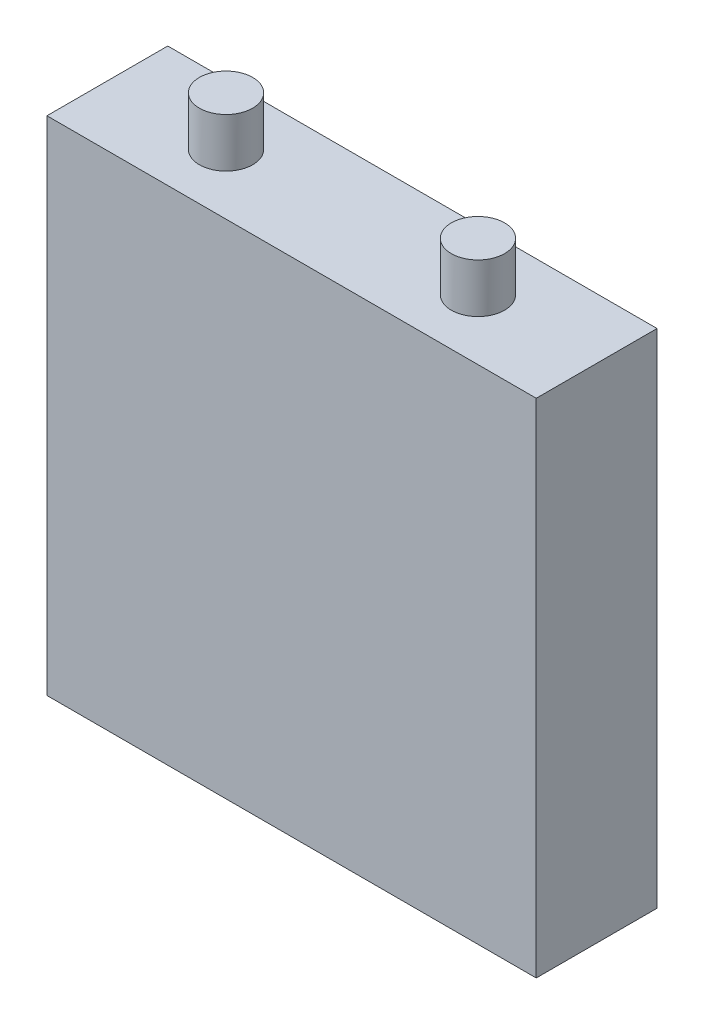
ISO-10303-21;
HEADER;
FILE_DESCRIPTION(('STEP AP214'),'2;1');
FILE_NAME('part.step','',(''),(''),'','','');
FILE_SCHEMA(('AUTOMOTIVE_DESIGN { 1 0 10303 214 1 1 1 1 }'));
ENDSEC;
DATA;
#1=APPLICATION_CONTEXT('core data for automotive mechanical design processes');
#2=APPLICATION_PROTOCOL_DEFINITION('international standard','automotive_design',2000,#1);
#3=PRODUCT_CONTEXT('',#1,'mechanical');
#4=PRODUCT('Part','Part','',(#3));
#5=PRODUCT_RELATED_PRODUCT_CATEGORY('part','',(#4));
#6=PRODUCT_DEFINITION_FORMATION('','',#4);
#7=PRODUCT_DEFINITION_CONTEXT('part definition',#1,'design');
#8=PRODUCT_DEFINITION('design','',#6,#7);
#9=PRODUCT_DEFINITION_SHAPE('','',#8);
#10=(LENGTH_UNIT() NAMED_UNIT(*) SI_UNIT(.MILLI.,.METRE.));
#11=(NAMED_UNIT(*) PLANE_ANGLE_UNIT() SI_UNIT($,.RADIAN.));
#12=(NAMED_UNIT(*) SI_UNIT($,.STERADIAN.) SOLID_ANGLE_UNIT());
#13=UNCERTAINTY_MEASURE_WITH_UNIT(LENGTH_MEASURE(1.E-05),#10,'distance_accuracy_value','');
#14=(GEOMETRIC_REPRESENTATION_CONTEXT(3) GLOBAL_UNCERTAINTY_ASSIGNED_CONTEXT((#13)) GLOBAL_UNIT_ASSIGNED_CONTEXT((#10,
#11,#12)) REPRESENTATION_CONTEXT('',''));
#15=CARTESIAN_POINT('',(0.,0.,0.));
#16=DIRECTION('',(0.,0.,1.));
#17=DIRECTION('',(1.,0.,0.));
#18=AXIS2_PLACEMENT_3D('',#15,#16,#17);
#19=CARTESIAN_POINT('',(0.,141.3,0.));
#20=DIRECTION('',(1.,0.,0.));
#21=DIRECTION('',(0.,0.,-1.));
#22=AXIS2_PLACEMENT_3D('',#19,#20,#21);
#23=PLANE('',#22);
#24=DIRECTION('',(0.,0.,1.));
#25=VECTOR('',#24,1.);
#26=CARTESIAN_POINT('',(0.,0.,0.));
#27=LINE('',#26,#25);
#28=CARTESIAN_POINT('',(0.,0.,-34.));
#29=VERTEX_POINT('',#28);
#30=CARTESIAN_POINT('',(0.,0.,0.));
#31=VERTEX_POINT('',#30);
#32=EDGE_CURVE('E111',#29,#31,#27,.T.);
#33=ORIENTED_EDGE('',*,*,#32,.T.);
#34=DIRECTION('',(0.,-1.,0.));
#35=VECTOR('',#34,1.);
#36=CARTESIAN_POINT('',(0.,141.3,0.));
#37=LINE('',#36,#35);
#38=CARTESIAN_POINT('',(0.,141.3,0.));
#39=VERTEX_POINT('',#38);
#40=EDGE_CURVE('E100',#39,#31,#37,.T.);
#41=ORIENTED_EDGE('',*,*,#40,.F.);
#42=DIRECTION('',(0.,0.,1.));
#43=VECTOR('',#42,1.);
#44=CARTESIAN_POINT('',(0.,141.3,0.));
#45=LINE('',#44,#43);
#46=CARTESIAN_POINT('',(0.,141.3,-34.));
#47=VERTEX_POINT('',#46);
#48=EDGE_CURVE('E92',#47,#39,#45,.T.);
#49=ORIENTED_EDGE('',*,*,#48,.F.);
#50=DIRECTION('',(0.,-1.,0.));
#51=VECTOR('',#50,1.);
#52=CARTESIAN_POINT('',(0.,141.3,-34.));
#53=LINE('',#52,#51);
#54=EDGE_CURVE('E107',#47,#29,#53,.T.);
#55=ORIENTED_EDGE('',*,*,#54,.T.);
#56=EDGE_LOOP('',(#33,#41,#49,#55));
#57=FACE_BOUND('',#56,.T.);
#58=ADVANCED_FACE('F39',(#57),#23,.F.);
#59=CARTESIAN_POINT('',(0.,141.3,0.));
#60=DIRECTION('',(0.,0.,-1.));
#61=DIRECTION('',(-1.,0.,0.));
#62=AXIS2_PLACEMENT_3D('',#59,#60,#61);
#63=PLANE('',#62);
#64=DIRECTION('',(1.,0.,0.));
#65=VECTOR('',#64,1.);
#66=CARTESIAN_POINT('',(0.,0.,0.));
#67=LINE('',#66,#65);
#68=CARTESIAN_POINT('',(137.7,0.,0.));
#69=VERTEX_POINT('',#68);
#70=EDGE_CURVE('E98',#31,#69,#67,.T.);
#71=ORIENTED_EDGE('',*,*,#70,.T.);
#72=DIRECTION('',(0.,-1.,0.));
#73=VECTOR('',#72,1.);
#74=CARTESIAN_POINT('',(137.7,141.3,0.));
#75=LINE('',#74,#73);
#76=CARTESIAN_POINT('',(137.7,141.3,0.));
#77=VERTEX_POINT('',#76);
#78=EDGE_CURVE('E96',#77,#69,#75,.T.);
#79=ORIENTED_EDGE('',*,*,#78,.F.);
#80=DIRECTION('',(1.,0.,0.));
#81=VECTOR('',#80,1.);
#82=CARTESIAN_POINT('',(0.,141.3,0.));
#83=LINE('',#82,#81);
#84=EDGE_CURVE('E87',#39,#77,#83,.T.);
#85=ORIENTED_EDGE('',*,*,#84,.F.);
#86=ORIENTED_EDGE('',*,*,#40,.T.);
#87=EDGE_LOOP('',(#71,#79,#85,#86));
#88=FACE_BOUND('',#87,.T.);
#89=ADVANCED_FACE('F97',(#88),#63,.F.);
#90=CARTESIAN_POINT('',(137.7,141.3,0.));
#91=DIRECTION('',(-1.,0.,0.));
#92=DIRECTION('',(0.,0.,1.));
#93=AXIS2_PLACEMENT_3D('',#90,#91,#92);
#94=PLANE('',#93);
#95=DIRECTION('',(0.,0.,-1.));
#96=VECTOR('',#95,1.);
#97=CARTESIAN_POINT('',(137.7,0.,0.));
#98=LINE('',#97,#96);
#99=CARTESIAN_POINT('',(137.7,0.,-34.));
#100=VERTEX_POINT('',#99);
#101=EDGE_CURVE('E73',#69,#100,#98,.T.);
#102=ORIENTED_EDGE('',*,*,#101,.T.);
#103=DIRECTION('',(0.,-1.,0.));
#104=VECTOR('',#103,1.);
#105=CARTESIAN_POINT('',(137.7,141.3,-34.));
#106=LINE('',#105,#104);
#107=CARTESIAN_POINT('',(137.7,141.3,-34.));
#108=VERTEX_POINT('',#107);
#109=EDGE_CURVE('E101',#108,#100,#106,.T.);
#110=ORIENTED_EDGE('',*,*,#109,.F.);
#111=DIRECTION('',(0.,0.,-1.));
#112=VECTOR('',#111,1.);
#113=CARTESIAN_POINT('',(137.7,141.3,0.));
#114=LINE('',#113,#112);
#115=EDGE_CURVE('E90',#77,#108,#114,.T.);
#116=ORIENTED_EDGE('',*,*,#115,.F.);
#117=ORIENTED_EDGE('',*,*,#78,.T.);
#118=EDGE_LOOP('',(#102,#110,#116,#117));
#119=FACE_BOUND('',#118,.T.);
#120=ADVANCED_FACE('F103',(#119),#94,.F.);
#121=CARTESIAN_POINT('',(0.,141.3,-34.));
#122=DIRECTION('',(0.,0.,1.));
#123=DIRECTION('',(1.,0.,0.));
#124=AXIS2_PLACEMENT_3D('',#121,#122,#123);
#125=PLANE('',#124);
#126=DIRECTION('',(-1.,0.,0.));
#127=VECTOR('',#126,1.);
#128=CARTESIAN_POINT('',(0.,0.,-34.));
#129=LINE('',#128,#127);
#130=EDGE_CURVE('E79',#100,#29,#129,.T.);
#131=ORIENTED_EDGE('',*,*,#130,.T.);
#132=ORIENTED_EDGE('',*,*,#54,.F.);
#133=DIRECTION('',(-1.,0.,0.));
#134=VECTOR('',#133,1.);
#135=CARTESIAN_POINT('',(0.,141.3,-34.));
#136=LINE('',#135,#134);
#137=EDGE_CURVE('E56',#108,#47,#136,.T.);
#138=ORIENTED_EDGE('',*,*,#137,.F.);
#139=ORIENTED_EDGE('',*,*,#109,.T.);
#140=EDGE_LOOP('',(#131,#132,#138,#139));
#141=FACE_BOUND('',#140,.T.);
#142=ADVANCED_FACE('F135',(#141),#125,.F.);
#143=CARTESIAN_POINT('',(0.,141.3,0.));
#144=DIRECTION('',(0.,-1.,0.));
#145=DIRECTION('',(0.,0.,-1.));
#146=AXIS2_PLACEMENT_3D('',#143,#144,#145);
#147=PLANE('',#146);
#148=CARTESIAN_POINT('',(104.3,141.3,-17.));
#149=DIRECTION('',(0.,-1.,0.));
#150=DIRECTION('',(0.,0.,-1.));
#151=AXIS2_PLACEMENT_3D('',#148,#149,#150);
#152=CIRCLE('',#151,7.5);
#153=CARTESIAN_POINT('',(104.3,141.3,-24.5));
#154=VERTEX_POINT('',#153);
#155=EDGE_CURVE('E11',#154,#154,#152,.F.);
#156=ORIENTED_EDGE('',*,*,#155,.F.);
#157=EDGE_LOOP('',(#156));
#158=FACE_BOUND('',#157,.T.);
#159=CARTESIAN_POINT('',(33.4,141.3,-17.));
#160=DIRECTION('',(0.,-1.,0.));
#161=DIRECTION('',(0.,0.,-1.));
#162=AXIS2_PLACEMENT_3D('',#159,#160,#161);
#163=CIRCLE('',#162,7.5);
#164=CARTESIAN_POINT('',(33.4,141.3,-24.5));
#165=VERTEX_POINT('',#164);
#166=EDGE_CURVE('E48',#165,#165,#163,.F.);
#167=ORIENTED_EDGE('',*,*,#166,.F.);
#168=EDGE_LOOP('',(#167));
#169=FACE_BOUND('',#168,.T.);
#170=ORIENTED_EDGE('',*,*,#48,.T.);
#171=ORIENTED_EDGE('',*,*,#84,.T.);
#172=ORIENTED_EDGE('',*,*,#115,.T.);
#173=ORIENTED_EDGE('',*,*,#137,.T.);
#174=EDGE_LOOP('',(#170,#171,#172,#173));
#175=FACE_BOUND('',#174,.T.);
#176=ADVANCED_FACE('F88',(#158,#169,#175),#147,.F.);
#177=CARTESIAN_POINT('',(0.,0.,0.));
#178=DIRECTION('',(0.,-1.,0.));
#179=DIRECTION('',(0.,0.,-1.));
#180=AXIS2_PLACEMENT_3D('',#177,#178,#179);
#181=PLANE('',#180);
#182=ORIENTED_EDGE('',*,*,#32,.F.);
#183=ORIENTED_EDGE('',*,*,#130,.F.);
#184=ORIENTED_EDGE('',*,*,#101,.F.);
#185=ORIENTED_EDGE('',*,*,#70,.F.);
#186=EDGE_LOOP('',(#182,#183,#184,#185));
#187=FACE_BOUND('',#186,.T.);
#188=ADVANCED_FACE('F134',(#187),#181,.T.);
#189=CARTESIAN_POINT('',(33.4,155.1,-17.));
#190=DIRECTION('',(0.,-1.,0.));
#191=DIRECTION('',(0.,0.,-1.));
#192=AXIS2_PLACEMENT_3D('',#189,#190,#191);
#193=CYLINDRICAL_SURFACE('',#192,7.5);
#194=CARTESIAN_POINT('',(33.4,155.1,-17.));
#195=DIRECTION('',(0.,1.,0.));
#196=DIRECTION('',(0.,0.,1.));
#197=AXIS2_PLACEMENT_3D('',#194,#195,#196);
#198=CIRCLE('',#197,7.5);
#199=CARTESIAN_POINT('',(33.4,155.1,-9.5));
#200=VERTEX_POINT('',#199);
#201=EDGE_CURVE('E115',#200,#200,#198,.T.);
#202=ORIENTED_EDGE('',*,*,#201,.F.);
#203=EDGE_LOOP('',(#202));
#204=FACE_BOUND('',#203,.T.);
#205=ORIENTED_EDGE('',*,*,#166,.T.);
#206=EDGE_LOOP('',(#205));
#207=FACE_BOUND('',#206,.T.);
#208=ADVANCED_FACE('F131',(#204,#207),#193,.T.);
#209=CARTESIAN_POINT('',(33.4,155.1,-17.));
#210=DIRECTION('',(0.,1.,0.));
#211=DIRECTION('',(0.,0.,1.));
#212=AXIS2_PLACEMENT_3D('',#209,#210,#211);
#213=PLANE('',#212);
#214=ORIENTED_EDGE('',*,*,#201,.T.);
#215=EDGE_LOOP('',(#214));
#216=FACE_BOUND('',#215,.T.);
#217=ADVANCED_FACE('F168',(#216),#213,.T.);
#218=CARTESIAN_POINT('',(104.3,155.1,-17.));
#219=DIRECTION('',(0.,-1.,0.));
#220=DIRECTION('',(0.,0.,-1.));
#221=AXIS2_PLACEMENT_3D('',#218,#219,#220);
#222=CYLINDRICAL_SURFACE('',#221,7.5);
#223=CARTESIAN_POINT('',(104.3,155.1,-17.));
#224=DIRECTION('',(0.,1.,0.));
#225=DIRECTION('',(0.,0.,1.));
#226=AXIS2_PLACEMENT_3D('',#223,#224,#225);
#227=CIRCLE('',#226,7.5);
#228=CARTESIAN_POINT('',(104.3,155.1,-9.5));
#229=VERTEX_POINT('',#228);
#230=EDGE_CURVE('E158',#229,#229,#227,.T.);
#231=ORIENTED_EDGE('',*,*,#230,.F.);
#232=EDGE_LOOP('',(#231));
#233=FACE_BOUND('',#232,.T.);
#234=ORIENTED_EDGE('',*,*,#155,.T.);
#235=EDGE_LOOP('',(#234));
#236=FACE_BOUND('',#235,.T.);
#237=ADVANCED_FACE('F165',(#233,#236),#222,.T.);
#238=CARTESIAN_POINT('',(104.3,155.1,-17.));
#239=DIRECTION('',(0.,1.,0.));
#240=DIRECTION('',(0.,0.,1.));
#241=AXIS2_PLACEMENT_3D('',#238,#239,#240);
#242=PLANE('',#241);
#243=ORIENTED_EDGE('',*,*,#230,.T.);
#244=EDGE_LOOP('',(#243));
#245=FACE_BOUND('',#244,.T.);
#246=ADVANCED_FACE('F163',(#245),#242,.T.);
#247=CLOSED_SHELL('',(#58,#89,#120,#142,#176,#188,#208,#217,#237,#246));
#248=MANIFOLD_SOLID_BREP('B2',#247);
#249=ADVANCED_BREP_SHAPE_REPRESENTATION('',(#18,#248),#14);
#250=SHAPE_DEFINITION_REPRESENTATION(#9,#249);
ENDSEC;
END-ISO-10303-21;
